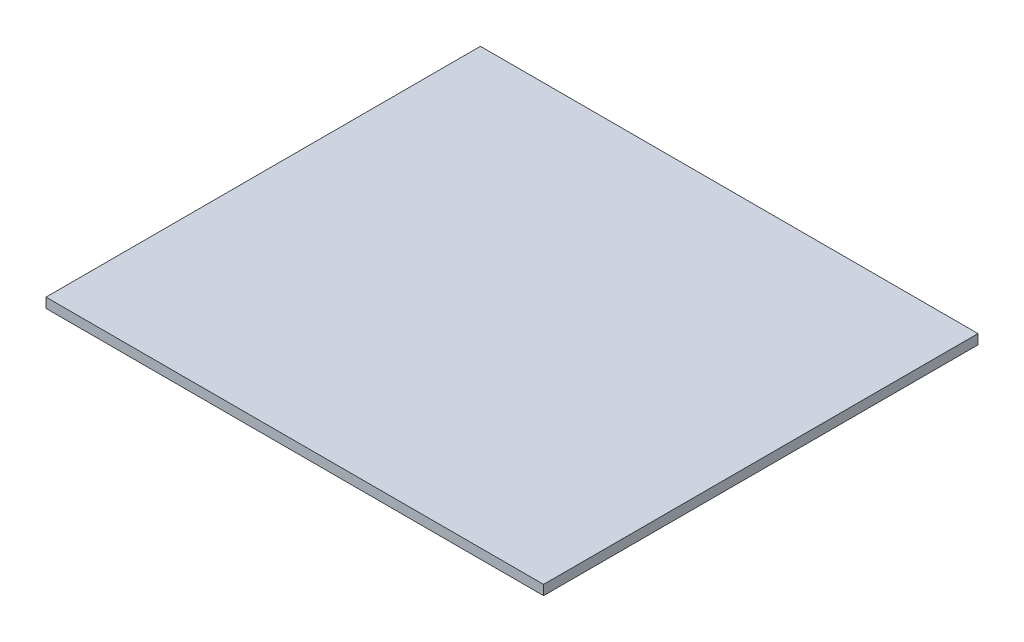
ISO-10303-21;
HEADER;
FILE_DESCRIPTION(('STEP AP214'),'2;1');
FILE_NAME('part.step','',(''),(''),'','','');
FILE_SCHEMA(('AUTOMOTIVE_DESIGN { 1 0 10303 214 1 1 1 1 }'));
ENDSEC;
DATA;
#1=APPLICATION_CONTEXT('core data for automotive mechanical design processes');
#2=APPLICATION_PROTOCOL_DEFINITION('international standard','automotive_design',2000,#1);
#3=PRODUCT_CONTEXT('',#1,'mechanical');
#4=PRODUCT('Part','Part','',(#3));
#5=PRODUCT_RELATED_PRODUCT_CATEGORY('part','',(#4));
#6=PRODUCT_DEFINITION_FORMATION('','',#4);
#7=PRODUCT_DEFINITION_CONTEXT('part definition',#1,'design');
#8=PRODUCT_DEFINITION('design','',#6,#7);
#9=PRODUCT_DEFINITION_SHAPE('','',#8);
#10=(LENGTH_UNIT() NAMED_UNIT(*) SI_UNIT(.MILLI.,.METRE.));
#11=(NAMED_UNIT(*) PLANE_ANGLE_UNIT() SI_UNIT($,.RADIAN.));
#12=(NAMED_UNIT(*) SI_UNIT($,.STERADIAN.) SOLID_ANGLE_UNIT());
#13=UNCERTAINTY_MEASURE_WITH_UNIT(LENGTH_MEASURE(1.E-05),#10,'distance_accuracy_value','');
#14=(GEOMETRIC_REPRESENTATION_CONTEXT(3) GLOBAL_UNCERTAINTY_ASSIGNED_CONTEXT((#13)) GLOBAL_UNIT_ASSIGNED_CONTEXT((#10,
#11,#12)) REPRESENTATION_CONTEXT('',''));
#15=CARTESIAN_POINT('',(0.,0.,0.));
#16=DIRECTION('',(0.,0.,1.));
#17=DIRECTION('',(1.,0.,0.));
#18=AXIS2_PLACEMENT_3D('',#15,#16,#17);
#19=CARTESIAN_POINT('',(0.,19.05,0.));
#20=DIRECTION('',(1.,0.,0.));
#21=DIRECTION('',(0.,0.,-1.));
#22=AXIS2_PLACEMENT_3D('',#19,#20,#21);
#23=PLANE('',#22);
#24=DIRECTION('',(0.,-1.,0.));
#25=VECTOR('',#24,1.);
#26=CARTESIAN_POINT('',(0.,19.05,-731.8375));
#27=LINE('',#26,#25);
#28=CARTESIAN_POINT('',(0.,19.05,-731.8375));
#29=VERTEX_POINT('',#28);
#30=CARTESIAN_POINT('',(0.,2.53999999999988,-731.8375));
#31=VERTEX_POINT('',#30);
#32=EDGE_CURVE('E163',#29,#31,#27,.T.);
#33=ORIENTED_EDGE('',*,*,#32,.T.);
#34=DIRECTION('',(0.,0.,1.));
#35=VECTOR('',#34,1.);
#36=CARTESIAN_POINT('',(0.,2.53999999999988,0.));
#37=LINE('',#36,#35);
#38=CARTESIAN_POINT('',(0.,2.53999999999988,0.));
#39=VERTEX_POINT('',#38);
#40=EDGE_CURVE('E11',#31,#39,#37,.T.);
#41=ORIENTED_EDGE('',*,*,#40,.T.);
#42=DIRECTION('',(0.,-1.,0.));
#43=VECTOR('',#42,1.);
#44=CARTESIAN_POINT('',(0.,19.05,0.));
#45=LINE('',#44,#43);
#46=CARTESIAN_POINT('',(0.,19.05,0.));
#47=VERTEX_POINT('',#46);
#48=EDGE_CURVE('E105',#47,#39,#45,.T.);
#49=ORIENTED_EDGE('',*,*,#48,.F.);
#50=DIRECTION('',(0.,0.,1.));
#51=VECTOR('',#50,1.);
#52=CARTESIAN_POINT('',(0.,19.05,0.));
#53=LINE('',#52,#51);
#54=EDGE_CURVE('E111',#29,#47,#53,.T.);
#55=ORIENTED_EDGE('',*,*,#54,.F.);
#56=EDGE_LOOP('',(#33,#41,#49,#55));
#57=FACE_BOUND('',#56,.T.);
#58=ADVANCED_FACE('F43',(#57),#23,.F.);
#59=CARTESIAN_POINT('',(0.,19.05,0.));
#60=DIRECTION('',(0.,0.,-1.));
#61=DIRECTION('',(-1.,0.,0.));
#62=AXIS2_PLACEMENT_3D('',#59,#60,#61);
#63=PLANE('',#62);
#64=ORIENTED_EDGE('',*,*,#48,.T.);
#65=DIRECTION('',(1.,0.,0.));
#66=VECTOR('',#65,1.);
#67=CARTESIAN_POINT('',(838.2,2.53999999999988,0.));
#68=LINE('',#67,#66);
#69=CARTESIAN_POINT('',(838.2,2.53999999999988,0.));
#70=VERTEX_POINT('',#69);
#71=EDGE_CURVE('E120',#39,#70,#68,.T.);
#72=ORIENTED_EDGE('',*,*,#71,.T.);
#73=DIRECTION('',(0.,-1.,0.));
#74=VECTOR('',#73,1.);
#75=CARTESIAN_POINT('',(838.2,19.05,0.));
#76=LINE('',#75,#74);
#77=CARTESIAN_POINT('',(838.2,19.05,0.));
#78=VERTEX_POINT('',#77);
#79=EDGE_CURVE('E107',#78,#70,#76,.T.);
#80=ORIENTED_EDGE('',*,*,#79,.F.);
#81=DIRECTION('',(1.,0.,0.));
#82=VECTOR('',#81,1.);
#83=CARTESIAN_POINT('',(0.,19.05,0.));
#84=LINE('',#83,#82);
#85=EDGE_CURVE('E100',#47,#78,#84,.T.);
#86=ORIENTED_EDGE('',*,*,#85,.F.);
#87=EDGE_LOOP('',(#64,#72,#80,#86));
#88=FACE_BOUND('',#87,.T.);
#89=ADVANCED_FACE('F102',(#88),#63,.F.);
#90=CARTESIAN_POINT('',(838.2,19.05,0.));
#91=DIRECTION('',(-1.,0.,0.));
#92=DIRECTION('',(0.,0.,1.));
#93=AXIS2_PLACEMENT_3D('',#90,#91,#92);
#94=PLANE('',#93);
#95=ORIENTED_EDGE('',*,*,#79,.T.);
#96=DIRECTION('',(0.,0.,-1.));
#97=VECTOR('',#96,1.);
#98=CARTESIAN_POINT('',(838.2,2.53999999999988,-731.8375));
#99=LINE('',#98,#97);
#100=CARTESIAN_POINT('',(838.2,2.53999999999988,-731.8375));
#101=VERTEX_POINT('',#100);
#102=EDGE_CURVE('E68',#70,#101,#99,.T.);
#103=ORIENTED_EDGE('',*,*,#102,.T.);
#104=DIRECTION('',(0.,-1.,0.));
#105=VECTOR('',#104,1.);
#106=CARTESIAN_POINT('',(838.2,19.05,-731.8375));
#107=LINE('',#106,#105);
#108=CARTESIAN_POINT('',(838.2,19.05,-731.8375));
#109=VERTEX_POINT('',#108);
#110=EDGE_CURVE('E124',#109,#101,#107,.T.);
#111=ORIENTED_EDGE('',*,*,#110,.F.);
#112=DIRECTION('',(0.,0.,-1.));
#113=VECTOR('',#112,1.);
#114=CARTESIAN_POINT('',(838.2,19.05,0.));
#115=LINE('',#114,#113);
#116=EDGE_CURVE('E110',#78,#109,#115,.T.);
#117=ORIENTED_EDGE('',*,*,#116,.F.);
#118=EDGE_LOOP('',(#95,#103,#111,#117));
#119=FACE_BOUND('',#118,.T.);
#120=ADVANCED_FACE('F161',(#119),#94,.F.);
#121=CARTESIAN_POINT('',(0.,19.05,-731.8375));
#122=DIRECTION('',(0.,0.,1.));
#123=DIRECTION('',(1.,0.,0.));
#124=AXIS2_PLACEMENT_3D('',#121,#122,#123);
#125=PLANE('',#124);
#126=ORIENTED_EDGE('',*,*,#110,.T.);
#127=DIRECTION('',(-1.,0.,0.));
#128=VECTOR('',#127,1.);
#129=CARTESIAN_POINT('',(0.,2.53999999999988,-731.8375));
#130=LINE('',#129,#128);
#131=EDGE_CURVE('E53',#101,#31,#130,.T.);
#132=ORIENTED_EDGE('',*,*,#131,.T.);
#133=ORIENTED_EDGE('',*,*,#32,.F.);
#134=DIRECTION('',(-1.,0.,0.));
#135=VECTOR('',#134,1.);
#136=CARTESIAN_POINT('',(0.,19.05,-731.8375));
#137=LINE('',#136,#135);
#138=EDGE_CURVE('E116',#109,#29,#137,.T.);
#139=ORIENTED_EDGE('',*,*,#138,.F.);
#140=EDGE_LOOP('',(#126,#132,#133,#139));
#141=FACE_BOUND('',#140,.T.);
#142=ADVANCED_FACE('F166',(#141),#125,.F.);
#143=CARTESIAN_POINT('',(0.,19.05,0.));
#144=DIRECTION('',(0.,-1.,0.));
#145=DIRECTION('',(0.,0.,-1.));
#146=AXIS2_PLACEMENT_3D('',#143,#144,#145);
#147=PLANE('',#146);
#148=ORIENTED_EDGE('',*,*,#54,.T.);
#149=ORIENTED_EDGE('',*,*,#85,.T.);
#150=ORIENTED_EDGE('',*,*,#116,.T.);
#151=ORIENTED_EDGE('',*,*,#138,.T.);
#152=EDGE_LOOP('',(#148,#149,#150,#151));
#153=FACE_BOUND('',#152,.T.);
#154=ADVANCED_FACE('F114',(#153),#147,.F.);
#155=CARTESIAN_POINT('',(0.,0.,0.));
#156=DIRECTION('',(0.,-1.,0.));
#157=DIRECTION('',(0.,0.,-1.));
#158=AXIS2_PLACEMENT_3D('',#155,#156,#157);
#159=PLANE('',#158);
#160=DIRECTION('',(0.,0.,1.));
#161=VECTOR('',#160,1.);
#162=CARTESIAN_POINT('',(835.66,0.,0.));
#163=LINE('',#162,#161);
#164=CARTESIAN_POINT('',(835.66,0.,-729.2975));
#165=VERTEX_POINT('',#164);
#166=CARTESIAN_POINT('',(835.66,0.,-2.53999999999999));
#167=VERTEX_POINT('',#166);
#168=EDGE_CURVE('E131',#165,#167,#163,.T.);
#169=ORIENTED_EDGE('',*,*,#168,.T.);
#170=DIRECTION('',(-1.,0.,0.));
#171=VECTOR('',#170,1.);
#172=CARTESIAN_POINT('',(0.,0.,-2.53999999999999));
#173=LINE('',#172,#171);
#174=CARTESIAN_POINT('',(2.53999999999999,0.,-2.53999999999999));
#175=VERTEX_POINT('',#174);
#176=EDGE_CURVE('E133',#167,#175,#173,.T.);
#177=ORIENTED_EDGE('',*,*,#176,.T.);
#178=DIRECTION('',(0.,0.,-1.));
#179=VECTOR('',#178,1.);
#180=CARTESIAN_POINT('',(2.53999999999999,0.,-731.8375));
#181=LINE('',#180,#179);
#182=CARTESIAN_POINT('',(2.53999999999999,0.,-729.2975));
#183=VERTEX_POINT('',#182);
#184=EDGE_CURVE('E122',#175,#183,#181,.T.);
#185=ORIENTED_EDGE('',*,*,#184,.T.);
#186=DIRECTION('',(1.,0.,0.));
#187=VECTOR('',#186,1.);
#188=CARTESIAN_POINT('',(838.2,0.,-729.2975));
#189=LINE('',#188,#187);
#190=EDGE_CURVE('E129',#183,#165,#189,.T.);
#191=ORIENTED_EDGE('',*,*,#190,.T.);
#192=EDGE_LOOP('',(#169,#177,#185,#191));
#193=FACE_BOUND('',#192,.T.);
#194=ADVANCED_FACE('F154',(#193),#159,.T.);
#195=CARTESIAN_POINT('',(0.,2.53999999999988,-731.8375));
#196=DIRECTION('',(0.,-0.707106781186563,-0.707106781186532));
#197=DIRECTION('',(1.,0.,0.));
#198=AXIS2_PLACEMENT_3D('',#195,#196,#197);
#199=PLANE('',#198);
#200=DIRECTION('',(-0.577350269189634,-0.577350269189609,0.577350269189634));
#201=VECTOR('',#200,1.);
#202=CARTESIAN_POINT('',(558.799999999992,-276.859999999996,-452.437499999992));
#203=LINE('',#202,#201);
#204=EDGE_CURVE('E141',#165,#101,#203,.F.);
#205=ORIENTED_EDGE('',*,*,#204,.F.);
#206=ORIENTED_EDGE('',*,*,#190,.F.);
#207=DIRECTION('',(0.577350269189634,-0.577350269189609,0.577350269189634));
#208=VECTOR('',#207,1.);
#209=CARTESIAN_POINT('',(243.94583333334,-241.40583333333,-487.891666666659));
#210=LINE('',#209,#208);
#211=EDGE_CURVE('E48',#31,#183,#210,.T.);
#212=ORIENTED_EDGE('',*,*,#211,.F.);
#213=ORIENTED_EDGE('',*,*,#131,.F.);
#214=EDGE_LOOP('',(#205,#206,#212,#213));
#215=FACE_BOUND('',#214,.T.);
#216=ADVANCED_FACE('F46',(#215),#199,.T.);
#217=CARTESIAN_POINT('',(0.,2.53999999999988,0.));
#218=DIRECTION('',(-0.707106781186532,-0.707106781186563,0.));
#219=DIRECTION('',(0.,0.,-1.));
#220=AXIS2_PLACEMENT_3D('',#217,#218,#219);
#221=PLANE('',#220);
#222=ORIENTED_EDGE('',*,*,#211,.T.);
#223=ORIENTED_EDGE('',*,*,#184,.F.);
#224=DIRECTION('',(-0.577350269189634,0.577350269189609,0.577350269189634));
#225=VECTOR('',#224,1.);
#226=CARTESIAN_POINT('',(0.,2.53999999999988,0.));
#227=LINE('',#226,#225);
#228=EDGE_CURVE('E140',#39,#175,#227,.F.);
#229=ORIENTED_EDGE('',*,*,#228,.F.);
#230=ORIENTED_EDGE('',*,*,#40,.F.);
#231=EDGE_LOOP('',(#222,#223,#229,#230));
#232=FACE_BOUND('',#231,.T.);
#233=ADVANCED_FACE('F150',(#232),#221,.T.);
#234=CARTESIAN_POINT('',(838.2,2.53999999999988,0.));
#235=DIRECTION('',(0.707106781186532,-0.707106781186563,0.));
#236=DIRECTION('',(0.,0.,1.));
#237=AXIS2_PLACEMENT_3D('',#234,#235,#236);
#238=PLANE('',#237);
#239=ORIENTED_EDGE('',*,*,#204,.T.);
#240=ORIENTED_EDGE('',*,*,#102,.F.);
#241=DIRECTION('',(-0.577350269189634,-0.577350269189609,-0.577350269189634));
#242=VECTOR('',#241,1.);
#243=CARTESIAN_POINT('',(838.2,2.53999999999988,0.));
#244=LINE('',#243,#242);
#245=EDGE_CURVE('E138',#167,#70,#244,.F.);
#246=ORIENTED_EDGE('',*,*,#245,.F.);
#247=ORIENTED_EDGE('',*,*,#168,.F.);
#248=EDGE_LOOP('',(#239,#240,#246,#247));
#249=FACE_BOUND('',#248,.T.);
#250=ADVANCED_FACE('F160',(#249),#238,.T.);
#251=CARTESIAN_POINT('',(0.,2.53999999999988,0.));
#252=DIRECTION('',(0.,-0.707106781186563,0.707106781186532));
#253=DIRECTION('',(-1.,0.,0.));
#254=AXIS2_PLACEMENT_3D('',#251,#252,#253);
#255=PLANE('',#254);
#256=ORIENTED_EDGE('',*,*,#228,.T.);
#257=ORIENTED_EDGE('',*,*,#176,.F.);
#258=ORIENTED_EDGE('',*,*,#245,.T.);
#259=ORIENTED_EDGE('',*,*,#71,.F.);
#260=EDGE_LOOP('',(#256,#257,#258,#259));
#261=FACE_BOUND('',#260,.T.);
#262=ADVANCED_FACE('F158',(#261),#255,.T.);
#263=CLOSED_SHELL('',(#58,#89,#120,#142,#154,#194,#216,#233,#250,#262));
#264=MANIFOLD_SOLID_BREP('B2',#263);
#265=ADVANCED_BREP_SHAPE_REPRESENTATION('',(#18,#264),#14);
#266=SHAPE_DEFINITION_REPRESENTATION(#9,#265);
ENDSEC;
END-ISO-10303-21;
